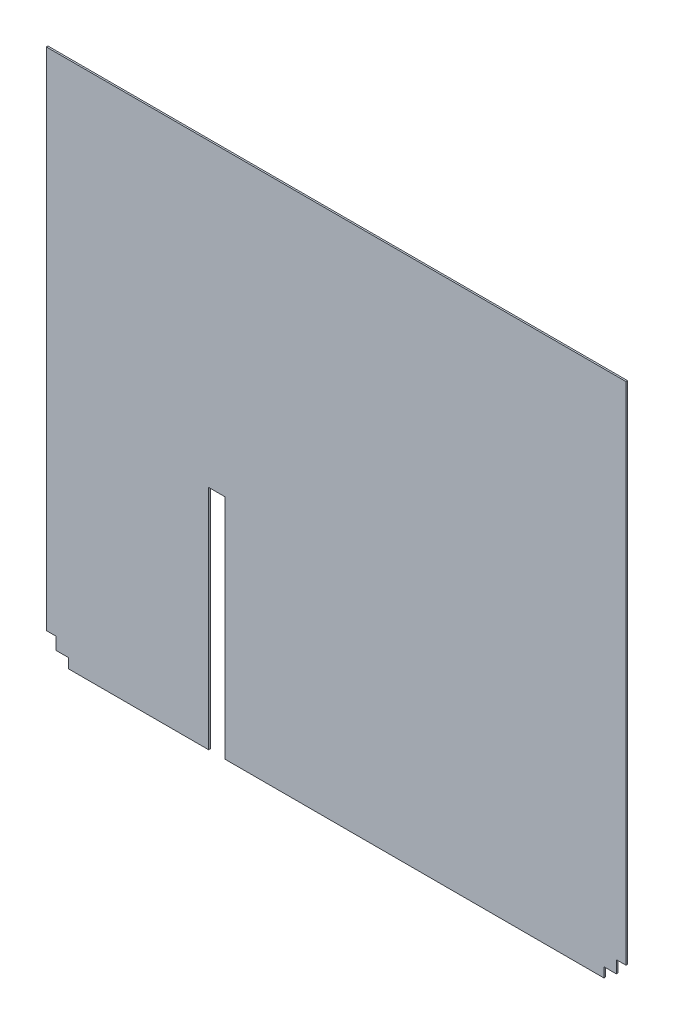
ISO-10303-21;
HEADER;
FILE_DESCRIPTION(('STEP AP214'),'2;1');
FILE_NAME('part.step','',(''),(''),'','','');
FILE_SCHEMA(('AUTOMOTIVE_DESIGN { 1 0 10303 214 1 1 1 1 }'));
ENDSEC;
DATA;
#1=APPLICATION_CONTEXT('core data for automotive mechanical design processes');
#2=APPLICATION_PROTOCOL_DEFINITION('international standard','automotive_design',2000,#1);
#3=PRODUCT_CONTEXT('',#1,'mechanical');
#4=PRODUCT('Part','Part','',(#3));
#5=PRODUCT_RELATED_PRODUCT_CATEGORY('part','',(#4));
#6=PRODUCT_DEFINITION_FORMATION('','',#4);
#7=PRODUCT_DEFINITION_CONTEXT('part definition',#1,'design');
#8=PRODUCT_DEFINITION('design','',#6,#7);
#9=PRODUCT_DEFINITION_SHAPE('','',#8);
#10=(LENGTH_UNIT() NAMED_UNIT(*) SI_UNIT(.MILLI.,.METRE.));
#11=(NAMED_UNIT(*) PLANE_ANGLE_UNIT() SI_UNIT($,.RADIAN.));
#12=(NAMED_UNIT(*) SI_UNIT($,.STERADIAN.) SOLID_ANGLE_UNIT());
#13=UNCERTAINTY_MEASURE_WITH_UNIT(LENGTH_MEASURE(1.E-05),#10,'distance_accuracy_value','');
#14=(GEOMETRIC_REPRESENTATION_CONTEXT(3) GLOBAL_UNCERTAINTY_ASSIGNED_CONTEXT((#13)) GLOBAL_UNIT_ASSIGNED_CONTEXT((#10,
#11,#12)) REPRESENTATION_CONTEXT('',''));
#15=CARTESIAN_POINT('',(0.,0.,0.));
#16=DIRECTION('',(0.,0.,1.));
#17=DIRECTION('',(1.,0.,0.));
#18=AXIS2_PLACEMENT_3D('',#15,#16,#17);
#19=CARTESIAN_POINT('',(0.,355.6,2.54));
#20=DIRECTION('',(0.,1.,0.));
#21=DIRECTION('',(0.,0.,1.));
#22=AXIS2_PLACEMENT_3D('',#19,#20,#21);
#23=PLANE('',#22);
#24=DIRECTION('',(1.,0.,0.));
#25=VECTOR('',#24,1.);
#26=CARTESIAN_POINT('',(0.,355.6,0.));
#27=LINE('',#26,#25);
#28=CARTESIAN_POINT('',(254.,355.6,0.));
#29=VERTEX_POINT('',#28);
#30=CARTESIAN_POINT('',(279.4,355.6,0.));
#31=VERTEX_POINT('',#30);
#32=EDGE_CURVE('E275',#29,#31,#27,.T.);
#33=ORIENTED_EDGE('',*,*,#32,.T.);
#34=DIRECTION('',(0.,0.,-1.));
#35=VECTOR('',#34,1.);
#36=CARTESIAN_POINT('',(279.4,355.6,2.54));
#37=LINE('',#36,#35);
#38=CARTESIAN_POINT('',(279.4,355.6,2.54));
#39=VERTEX_POINT('',#38);
#40=EDGE_CURVE('E11',#39,#31,#37,.T.);
#41=ORIENTED_EDGE('',*,*,#40,.F.);
#42=DIRECTION('',(1.,0.,0.));
#43=VECTOR('',#42,1.);
#44=CARTESIAN_POINT('',(0.,355.6,2.54));
#45=LINE('',#44,#43);
#46=CARTESIAN_POINT('',(254.,355.6,2.54));
#47=VERTEX_POINT('',#46);
#48=EDGE_CURVE('E206',#47,#39,#45,.T.);
#49=ORIENTED_EDGE('',*,*,#48,.F.);
#50=DIRECTION('',(0.,0.,-1.));
#51=VECTOR('',#50,1.);
#52=CARTESIAN_POINT('',(254.,355.6,2.54));
#53=LINE('',#52,#51);
#54=EDGE_CURVE('E193',#47,#29,#53,.T.);
#55=ORIENTED_EDGE('',*,*,#54,.T.);
#56=EDGE_LOOP('',(#33,#41,#49,#55));
#57=FACE_BOUND('',#56,.T.);
#58=ADVANCED_FACE('F47',(#57),#23,.F.);
#59=CARTESIAN_POINT('',(279.4,0.,2.54));
#60=DIRECTION('',(1.,0.,0.));
#61=DIRECTION('',(0.,1.,0.));
#62=AXIS2_PLACEMENT_3D('',#59,#60,#61);
#63=PLANE('',#62);
#64=DIRECTION('',(0.,-1.,0.));
#65=VECTOR('',#64,1.);
#66=CARTESIAN_POINT('',(279.4,0.,0.));
#67=LINE('',#66,#65);
#68=CARTESIAN_POINT('',(279.4,0.,0.));
#69=VERTEX_POINT('',#68);
#70=EDGE_CURVE('E266',#31,#69,#67,.T.);
#71=ORIENTED_EDGE('',*,*,#70,.T.);
#72=DIRECTION('',(0.,0.,-1.));
#73=VECTOR('',#72,1.);
#74=CARTESIAN_POINT('',(279.4,0.,2.54));
#75=LINE('',#74,#73);
#76=CARTESIAN_POINT('',(279.4,0.,2.54));
#77=VERTEX_POINT('',#76);
#78=EDGE_CURVE('E56',#77,#69,#75,.T.);
#79=ORIENTED_EDGE('',*,*,#78,.F.);
#80=DIRECTION('',(0.,-1.,0.));
#81=VECTOR('',#80,1.);
#82=CARTESIAN_POINT('',(279.4,0.,2.54));
#83=LINE('',#82,#81);
#84=EDGE_CURVE('E131',#39,#77,#83,.T.);
#85=ORIENTED_EDGE('',*,*,#84,.F.);
#86=ORIENTED_EDGE('',*,*,#40,.T.);
#87=EDGE_LOOP('',(#71,#79,#85,#86));
#88=FACE_BOUND('',#87,.T.);
#89=ADVANCED_FACE('F389',(#88),#63,.F.);
#90=CARTESIAN_POINT('',(0.,0.,2.54));
#91=DIRECTION('',(0.,1.,0.));
#92=DIRECTION('',(0.,0.,1.));
#93=AXIS2_PLACEMENT_3D('',#90,#91,#92);
#94=PLANE('',#93);
#95=DIRECTION('',(1.,0.,0.));
#96=VECTOR('',#95,1.);
#97=CARTESIAN_POINT('',(0.,0.,0.));
#98=LINE('',#97,#96);
#99=CARTESIAN_POINT('',(872.45698,0.,0.));
#100=VERTEX_POINT('',#99);
#101=EDGE_CURVE('E215',#69,#100,#98,.T.);
#102=ORIENTED_EDGE('',*,*,#101,.T.);
#103=DIRECTION('',(0.,0.,-1.));
#104=VECTOR('',#103,1.);
#105=CARTESIAN_POINT('',(872.45698,0.,2.54));
#106=LINE('',#105,#104);
#107=CARTESIAN_POINT('',(872.45698,0.,2.54));
#108=VERTEX_POINT('',#107);
#109=EDGE_CURVE('E254',#108,#100,#106,.T.);
#110=ORIENTED_EDGE('',*,*,#109,.F.);
#111=DIRECTION('',(1.,0.,0.));
#112=VECTOR('',#111,1.);
#113=CARTESIAN_POINT('',(0.,0.,2.54));
#114=LINE('',#113,#112);
#115=EDGE_CURVE('E191',#77,#108,#114,.T.);
#116=ORIENTED_EDGE('',*,*,#115,.F.);
#117=ORIENTED_EDGE('',*,*,#78,.T.);
#118=EDGE_LOOP('',(#102,#110,#116,#117));
#119=FACE_BOUND('',#118,.T.);
#120=ADVANCED_FACE('F261',(#119),#94,.F.);
#121=CARTESIAN_POINT('',(872.45698,0.,2.54));
#122=DIRECTION('',(1.,0.,0.));
#123=DIRECTION('',(0.,0.,-1.));
#124=AXIS2_PLACEMENT_3D('',#121,#122,#123);
#125=PLANE('',#124);
#126=DIRECTION('',(0.,-1.,0.));
#127=VECTOR('',#126,1.);
#128=CARTESIAN_POINT('',(872.45698,0.,0.));
#129=LINE('',#128,#127);
#130=CARTESIAN_POINT('',(872.45698,15.24,0.));
#131=VERTEX_POINT('',#130);
#132=EDGE_CURVE('E269',#131,#100,#129,.T.);
#133=ORIENTED_EDGE('',*,*,#132,.F.);
#134=DIRECTION('',(0.,0.,-1.));
#135=VECTOR('',#134,1.);
#136=CARTESIAN_POINT('',(872.45698,15.24,2.54));
#137=LINE('',#136,#135);
#138=CARTESIAN_POINT('',(872.45698,15.24,2.54));
#139=VERTEX_POINT('',#138);
#140=EDGE_CURVE('E251',#139,#131,#137,.T.);
#141=ORIENTED_EDGE('',*,*,#140,.F.);
#142=DIRECTION('',(0.,-1.,0.));
#143=VECTOR('',#142,1.);
#144=CARTESIAN_POINT('',(872.45698,0.,2.54));
#145=LINE('',#144,#143);
#146=EDGE_CURVE('E198',#139,#108,#145,.T.);
#147=ORIENTED_EDGE('',*,*,#146,.T.);
#148=ORIENTED_EDGE('',*,*,#109,.T.);
#149=EDGE_LOOP('',(#133,#141,#147,#148));
#150=FACE_BOUND('',#149,.T.);
#151=ADVANCED_FACE('F396',(#150),#125,.T.);
#152=CARTESIAN_POINT('',(0.,15.2399999999999,2.54));
#153=DIRECTION('',(0.,-1.,0.));
#154=DIRECTION('',(1.,0.,0.));
#155=AXIS2_PLACEMENT_3D('',#152,#153,#154);
#156=PLANE('',#155);
#157=DIRECTION('',(-1.,0.,0.));
#158=VECTOR('',#157,1.);
#159=CARTESIAN_POINT('',(0.,15.2399999999999,0.));
#160=LINE('',#159,#158);
#161=CARTESIAN_POINT('',(891.76098,15.24,0.));
#162=VERTEX_POINT('',#161);
#163=EDGE_CURVE('E273',#162,#131,#160,.T.);
#164=ORIENTED_EDGE('',*,*,#163,.F.);
#165=DIRECTION('',(0.,0.,-1.));
#166=VECTOR('',#165,1.);
#167=CARTESIAN_POINT('',(891.76098,15.24,2.54));
#168=LINE('',#167,#166);
#169=CARTESIAN_POINT('',(891.76098,15.24,2.54));
#170=VERTEX_POINT('',#169);
#171=EDGE_CURVE('E248',#170,#162,#168,.T.);
#172=ORIENTED_EDGE('',*,*,#171,.F.);
#173=DIRECTION('',(-1.,0.,0.));
#174=VECTOR('',#173,1.);
#175=CARTESIAN_POINT('',(0.,15.2399999999999,2.54));
#176=LINE('',#175,#174);
#177=EDGE_CURVE('E205',#170,#139,#176,.T.);
#178=ORIENTED_EDGE('',*,*,#177,.T.);
#179=ORIENTED_EDGE('',*,*,#140,.T.);
#180=EDGE_LOOP('',(#164,#172,#178,#179));
#181=FACE_BOUND('',#180,.T.);
#182=ADVANCED_FACE('F350',(#181),#156,.T.);
#183=CARTESIAN_POINT('',(891.76098,0.,2.54));
#184=DIRECTION('',(1.,0.,0.));
#185=DIRECTION('',(0.,0.,-1.));
#186=AXIS2_PLACEMENT_3D('',#183,#184,#185);
#187=PLANE('',#186);
#188=DIRECTION('',(0.,-1.,0.));
#189=VECTOR('',#188,1.);
#190=CARTESIAN_POINT('',(891.76098,0.,0.));
#191=LINE('',#190,#189);
#192=CARTESIAN_POINT('',(891.76098,34.544,0.));
#193=VERTEX_POINT('',#192);
#194=EDGE_CURVE('E281',#193,#162,#191,.T.);
#195=ORIENTED_EDGE('',*,*,#194,.F.);
#196=DIRECTION('',(0.,0.,-1.));
#197=VECTOR('',#196,1.);
#198=CARTESIAN_POINT('',(891.76098,34.544,2.54));
#199=LINE('',#198,#197);
#200=CARTESIAN_POINT('',(891.76098,34.544,2.54));
#201=VERTEX_POINT('',#200);
#202=EDGE_CURVE('E245',#201,#193,#199,.T.);
#203=ORIENTED_EDGE('',*,*,#202,.F.);
#204=DIRECTION('',(0.,-1.,0.));
#205=VECTOR('',#204,1.);
#206=CARTESIAN_POINT('',(891.76098,0.,2.54));
#207=LINE('',#206,#205);
#208=EDGE_CURVE('E341',#201,#170,#207,.T.);
#209=ORIENTED_EDGE('',*,*,#208,.T.);
#210=ORIENTED_EDGE('',*,*,#171,.T.);
#211=EDGE_LOOP('',(#195,#203,#209,#210));
#212=FACE_BOUND('',#211,.T.);
#213=ADVANCED_FACE('F355',(#212),#187,.T.);
#214=CARTESIAN_POINT('',(0.,34.5439999999996,2.54));
#215=DIRECTION('',(0.,-1.,0.));
#216=DIRECTION('',(1.,0.,0.));
#217=AXIS2_PLACEMENT_3D('',#214,#215,#216);
#218=PLANE('',#217);
#219=DIRECTION('',(-1.,0.,0.));
#220=VECTOR('',#219,1.);
#221=CARTESIAN_POINT('',(0.,34.5439999999996,0.));
#222=LINE('',#221,#220);
#223=CARTESIAN_POINT('',(907.00098,34.544,0.));
#224=VERTEX_POINT('',#223);
#225=EDGE_CURVE('E285',#224,#193,#222,.T.);
#226=ORIENTED_EDGE('',*,*,#225,.F.);
#227=DIRECTION('',(0.,0.,-1.));
#228=VECTOR('',#227,1.);
#229=CARTESIAN_POINT('',(907.00098,34.544,2.54));
#230=LINE('',#229,#228);
#231=CARTESIAN_POINT('',(907.00098,34.544,2.54));
#232=VERTEX_POINT('',#231);
#233=EDGE_CURVE('E242',#232,#224,#230,.T.);
#234=ORIENTED_EDGE('',*,*,#233,.F.);
#235=DIRECTION('',(-1.,0.,0.));
#236=VECTOR('',#235,1.);
#237=CARTESIAN_POINT('',(0.,34.5439999999996,2.54));
#238=LINE('',#237,#236);
#239=EDGE_CURVE('E337',#232,#201,#238,.T.);
#240=ORIENTED_EDGE('',*,*,#239,.T.);
#241=ORIENTED_EDGE('',*,*,#202,.T.);
#242=EDGE_LOOP('',(#226,#234,#240,#241));
#243=FACE_BOUND('',#242,.T.);
#244=ADVANCED_FACE('F358',(#243),#218,.T.);
#245=CARTESIAN_POINT('',(907.00098,0.,2.54));
#246=DIRECTION('',(-1.,0.,0.));
#247=DIRECTION('',(0.,0.,1.));
#248=AXIS2_PLACEMENT_3D('',#245,#246,#247);
#249=PLANE('',#248);
#250=DIRECTION('',(0.,1.,0.));
#251=VECTOR('',#250,1.);
#252=CARTESIAN_POINT('',(907.00098,0.,0.));
#253=LINE('',#252,#251);
#254=CARTESIAN_POINT('',(907.00098,825.5,0.));
#255=VERTEX_POINT('',#254);
#256=EDGE_CURVE('E289',#224,#255,#253,.T.);
#257=ORIENTED_EDGE('',*,*,#256,.T.);
#258=DIRECTION('',(0.,0.,-1.));
#259=VECTOR('',#258,1.);
#260=CARTESIAN_POINT('',(907.00098,825.5,2.54));
#261=LINE('',#260,#259);
#262=CARTESIAN_POINT('',(907.00098,825.5,2.54));
#263=VERTEX_POINT('',#262);
#264=EDGE_CURVE('E239',#263,#255,#261,.T.);
#265=ORIENTED_EDGE('',*,*,#264,.F.);
#266=DIRECTION('',(0.,1.,0.));
#267=VECTOR('',#266,1.);
#268=CARTESIAN_POINT('',(907.00098,0.,2.54));
#269=LINE('',#268,#267);
#270=EDGE_CURVE('E334',#232,#263,#269,.T.);
#271=ORIENTED_EDGE('',*,*,#270,.F.);
#272=ORIENTED_EDGE('',*,*,#233,.T.);
#273=EDGE_LOOP('',(#257,#265,#271,#272));
#274=FACE_BOUND('',#273,.T.);
#275=ADVANCED_FACE('F364',(#274),#249,.F.);
#276=CARTESIAN_POINT('',(0.,825.5,2.54));
#277=DIRECTION('',(0.,1.,0.));
#278=DIRECTION('',(0.,0.,1.));
#279=AXIS2_PLACEMENT_3D('',#276,#277,#278);
#280=PLANE('',#279);
#281=DIRECTION('',(1.,0.,0.));
#282=VECTOR('',#281,1.);
#283=CARTESIAN_POINT('',(0.,825.5,0.));
#284=LINE('',#283,#282);
#285=CARTESIAN_POINT('',(0.,825.5,0.));
#286=VERTEX_POINT('',#285);
#287=EDGE_CURVE('E293',#286,#255,#284,.T.);
#288=ORIENTED_EDGE('',*,*,#287,.F.);
#289=DIRECTION('',(0.,0.,-1.));
#290=VECTOR('',#289,1.);
#291=CARTESIAN_POINT('',(0.,825.5,2.54));
#292=LINE('',#291,#290);
#293=CARTESIAN_POINT('',(0.,825.5,2.54));
#294=VERTEX_POINT('',#293);
#295=EDGE_CURVE('E236',#294,#286,#292,.T.);
#296=ORIENTED_EDGE('',*,*,#295,.F.);
#297=DIRECTION('',(1.,0.,0.));
#298=VECTOR('',#297,1.);
#299=CARTESIAN_POINT('',(0.,825.5,2.54));
#300=LINE('',#299,#298);
#301=EDGE_CURVE('E330',#294,#263,#300,.T.);
#302=ORIENTED_EDGE('',*,*,#301,.T.);
#303=ORIENTED_EDGE('',*,*,#264,.T.);
#304=EDGE_LOOP('',(#288,#296,#302,#303));
#305=FACE_BOUND('',#304,.T.);
#306=ADVANCED_FACE('F368',(#305),#280,.T.);
#307=CARTESIAN_POINT('',(0.,0.,2.54));
#308=DIRECTION('',(-1.,0.,0.));
#309=DIRECTION('',(0.,0.,1.));
#310=AXIS2_PLACEMENT_3D('',#307,#308,#309);
#311=PLANE('',#310);
#312=DIRECTION('',(0.,1.,0.));
#313=VECTOR('',#312,1.);
#314=CARTESIAN_POINT('',(0.,0.,0.));
#315=LINE('',#314,#313);
#316=CARTESIAN_POINT('',(0.,34.544,0.));
#317=VERTEX_POINT('',#316);
#318=EDGE_CURVE('E297',#317,#286,#315,.T.);
#319=ORIENTED_EDGE('',*,*,#318,.F.);
#320=DIRECTION('',(0.,0.,-1.));
#321=VECTOR('',#320,1.);
#322=CARTESIAN_POINT('',(0.,34.544,2.54));
#323=LINE('',#322,#321);
#324=CARTESIAN_POINT('',(0.,34.544,2.54));
#325=VERTEX_POINT('',#324);
#326=EDGE_CURVE('E233',#325,#317,#323,.T.);
#327=ORIENTED_EDGE('',*,*,#326,.F.);
#328=DIRECTION('',(0.,1.,0.));
#329=VECTOR('',#328,1.);
#330=CARTESIAN_POINT('',(0.,0.,2.54));
#331=LINE('',#330,#329);
#332=EDGE_CURVE('E326',#325,#294,#331,.T.);
#333=ORIENTED_EDGE('',*,*,#332,.T.);
#334=ORIENTED_EDGE('',*,*,#295,.T.);
#335=EDGE_LOOP('',(#319,#327,#333,#334));
#336=FACE_BOUND('',#335,.T.);
#337=ADVANCED_FACE('F371',(#336),#311,.T.);
#338=CARTESIAN_POINT('',(0.,34.544,2.54));
#339=DIRECTION('',(0.,1.,0.));
#340=DIRECTION('',(0.,0.,1.));
#341=AXIS2_PLACEMENT_3D('',#338,#339,#340);
#342=PLANE('',#341);
#343=DIRECTION('',(1.,0.,0.));
#344=VECTOR('',#343,1.);
#345=CARTESIAN_POINT('',(0.,34.544,0.));
#346=LINE('',#345,#344);
#347=CARTESIAN_POINT('',(15.24,34.544,0.));
#348=VERTEX_POINT('',#347);
#349=EDGE_CURVE('E301',#317,#348,#346,.T.);
#350=ORIENTED_EDGE('',*,*,#349,.T.);
#351=DIRECTION('',(0.,0.,-1.));
#352=VECTOR('',#351,1.);
#353=CARTESIAN_POINT('',(15.24,34.544,2.54));
#354=LINE('',#353,#352);
#355=CARTESIAN_POINT('',(15.24,34.544,2.54));
#356=VERTEX_POINT('',#355);
#357=EDGE_CURVE('E229',#356,#348,#354,.T.);
#358=ORIENTED_EDGE('',*,*,#357,.F.);
#359=DIRECTION('',(1.,0.,0.));
#360=VECTOR('',#359,1.);
#361=CARTESIAN_POINT('',(0.,34.544,2.54));
#362=LINE('',#361,#360);
#363=EDGE_CURVE('E323',#325,#356,#362,.T.);
#364=ORIENTED_EDGE('',*,*,#363,.F.);
#365=ORIENTED_EDGE('',*,*,#326,.T.);
#366=EDGE_LOOP('',(#350,#358,#364,#365));
#367=FACE_BOUND('',#366,.T.);
#368=ADVANCED_FACE('F376',(#367),#342,.F.);
#369=CARTESIAN_POINT('',(15.24,0.,2.54));
#370=DIRECTION('',(1.,0.,0.));
#371=DIRECTION('',(0.,1.,0.));
#372=AXIS2_PLACEMENT_3D('',#369,#370,#371);
#373=PLANE('',#372);
#374=DIRECTION('',(0.,-1.,0.));
#375=VECTOR('',#374,1.);
#376=CARTESIAN_POINT('',(15.24,0.,0.));
#377=LINE('',#376,#375);
#378=CARTESIAN_POINT('',(15.24,15.24,0.));
#379=VERTEX_POINT('',#378);
#380=EDGE_CURVE('E304',#348,#379,#377,.T.);
#381=ORIENTED_EDGE('',*,*,#380,.T.);
#382=DIRECTION('',(0.,0.,-1.));
#383=VECTOR('',#382,1.);
#384=CARTESIAN_POINT('',(15.24,15.24,2.54));
#385=LINE('',#384,#383);
#386=CARTESIAN_POINT('',(15.24,15.24,2.54));
#387=VERTEX_POINT('',#386);
#388=EDGE_CURVE('E225',#387,#379,#385,.T.);
#389=ORIENTED_EDGE('',*,*,#388,.F.);
#390=DIRECTION('',(0.,-1.,0.));
#391=VECTOR('',#390,1.);
#392=CARTESIAN_POINT('',(15.24,0.,2.54));
#393=LINE('',#392,#391);
#394=EDGE_CURVE('E320',#356,#387,#393,.T.);
#395=ORIENTED_EDGE('',*,*,#394,.F.);
#396=ORIENTED_EDGE('',*,*,#357,.T.);
#397=EDGE_LOOP('',(#381,#389,#395,#396));
#398=FACE_BOUND('',#397,.T.);
#399=ADVANCED_FACE('F379',(#398),#373,.F.);
#400=CARTESIAN_POINT('',(0.,15.24,2.54));
#401=DIRECTION('',(0.,1.,0.));
#402=DIRECTION('',(0.,0.,1.));
#403=AXIS2_PLACEMENT_3D('',#400,#401,#402);
#404=PLANE('',#403);
#405=DIRECTION('',(1.,0.,0.));
#406=VECTOR('',#405,1.);
#407=CARTESIAN_POINT('',(0.,15.24,0.));
#408=LINE('',#407,#406);
#409=CARTESIAN_POINT('',(34.544,15.24,0.));
#410=VERTEX_POINT('',#409);
#411=EDGE_CURVE('E306',#379,#410,#408,.T.);
#412=ORIENTED_EDGE('',*,*,#411,.T.);
#413=DIRECTION('',(0.,0.,-1.));
#414=VECTOR('',#413,1.);
#415=CARTESIAN_POINT('',(34.544,15.24,2.54));
#416=LINE('',#415,#414);
#417=CARTESIAN_POINT('',(34.544,15.24,2.54));
#418=VERTEX_POINT('',#417);
#419=EDGE_CURVE('E185',#418,#410,#416,.T.);
#420=ORIENTED_EDGE('',*,*,#419,.F.);
#421=DIRECTION('',(1.,0.,0.));
#422=VECTOR('',#421,1.);
#423=CARTESIAN_POINT('',(0.,15.24,2.54));
#424=LINE('',#423,#422);
#425=EDGE_CURVE('E174',#387,#418,#424,.T.);
#426=ORIENTED_EDGE('',*,*,#425,.F.);
#427=ORIENTED_EDGE('',*,*,#388,.T.);
#428=EDGE_LOOP('',(#412,#420,#426,#427));
#429=FACE_BOUND('',#428,.T.);
#430=ADVANCED_FACE('F311',(#429),#404,.F.);
#431=CARTESIAN_POINT('',(34.544,0.,2.54));
#432=DIRECTION('',(1.,0.,0.));
#433=DIRECTION('',(0.,0.,-1.));
#434=AXIS2_PLACEMENT_3D('',#431,#432,#433);
#435=PLANE('',#434);
#436=DIRECTION('',(0.,-1.,0.));
#437=VECTOR('',#436,1.);
#438=CARTESIAN_POINT('',(34.544,0.,0.));
#439=LINE('',#438,#437);
#440=CARTESIAN_POINT('',(34.544,0.,0.));
#441=VERTEX_POINT('',#440);
#442=EDGE_CURVE('E183',#410,#441,#439,.T.);
#443=ORIENTED_EDGE('',*,*,#442,.T.);
#444=DIRECTION('',(0.,0.,-1.));
#445=VECTOR('',#444,1.);
#446=CARTESIAN_POINT('',(34.544,0.,2.54));
#447=LINE('',#446,#445);
#448=CARTESIAN_POINT('',(34.544,0.,2.54));
#449=VERTEX_POINT('',#448);
#450=EDGE_CURVE('E180',#449,#441,#447,.T.);
#451=ORIENTED_EDGE('',*,*,#450,.F.);
#452=DIRECTION('',(0.,-1.,0.));
#453=VECTOR('',#452,1.);
#454=CARTESIAN_POINT('',(34.544,0.,2.54));
#455=LINE('',#454,#453);
#456=EDGE_CURVE('E168',#418,#449,#455,.T.);
#457=ORIENTED_EDGE('',*,*,#456,.F.);
#458=ORIENTED_EDGE('',*,*,#419,.T.);
#459=EDGE_LOOP('',(#443,#451,#457,#458));
#460=FACE_BOUND('',#459,.T.);
#461=ADVANCED_FACE('F181',(#460),#435,.F.);
#462=CARTESIAN_POINT('',(254.,0.,0.));
#463=VERTEX_POINT('',#462);
#464=EDGE_CURVE('E117',#441,#463,#98,.T.);
#465=ORIENTED_EDGE('',*,*,#464,.T.);
#466=DIRECTION('',(0.,0.,-1.));
#467=VECTOR('',#466,1.);
#468=CARTESIAN_POINT('',(254.,0.,2.54));
#469=LINE('',#468,#467);
#470=CARTESIAN_POINT('',(254.,0.,2.54));
#471=VERTEX_POINT('',#470);
#472=EDGE_CURVE('E186',#471,#463,#469,.T.);
#473=ORIENTED_EDGE('',*,*,#472,.F.);
#474=EDGE_CURVE('E172',#449,#471,#114,.T.);
#475=ORIENTED_EDGE('',*,*,#474,.F.);
#476=ORIENTED_EDGE('',*,*,#450,.T.);
#477=EDGE_LOOP('',(#465,#473,#475,#476));
#478=FACE_BOUND('',#477,.T.);
#479=ADVANCED_FACE('F188',(#478),#94,.F.);
#480=CARTESIAN_POINT('',(254.,0.,2.54));
#481=DIRECTION('',(-1.,0.,0.));
#482=DIRECTION('',(0.,-1.,0.));
#483=AXIS2_PLACEMENT_3D('',#480,#481,#482);
#484=PLANE('',#483);
#485=DIRECTION('',(0.,1.,0.));
#486=VECTOR('',#485,1.);
#487=CARTESIAN_POINT('',(254.,0.,0.));
#488=LINE('',#487,#486);
#489=EDGE_CURVE('E123',#463,#29,#488,.T.);
#490=ORIENTED_EDGE('',*,*,#489,.T.);
#491=ORIENTED_EDGE('',*,*,#54,.F.);
#492=DIRECTION('',(0.,1.,0.));
#493=VECTOR('',#492,1.);
#494=CARTESIAN_POINT('',(254.,0.,2.54));
#495=LINE('',#494,#493);
#496=EDGE_CURVE('E64',#471,#47,#495,.T.);
#497=ORIENTED_EDGE('',*,*,#496,.F.);
#498=ORIENTED_EDGE('',*,*,#472,.T.);
#499=EDGE_LOOP('',(#490,#491,#497,#498));
#500=FACE_BOUND('',#499,.T.);
#501=ADVANCED_FACE('F450',(#500),#484,.F.);
#502=CARTESIAN_POINT('',(0.,0.,2.54));
#503=DIRECTION('',(0.,0.,1.));
#504=DIRECTION('',(1.,0.,0.));
#505=AXIS2_PLACEMENT_3D('',#502,#503,#504);
#506=PLANE('',#505);
#507=ORIENTED_EDGE('',*,*,#48,.T.);
#508=ORIENTED_EDGE('',*,*,#84,.T.);
#509=ORIENTED_EDGE('',*,*,#115,.T.);
#510=ORIENTED_EDGE('',*,*,#146,.F.);
#511=ORIENTED_EDGE('',*,*,#177,.F.);
#512=ORIENTED_EDGE('',*,*,#208,.F.);
#513=ORIENTED_EDGE('',*,*,#239,.F.);
#514=ORIENTED_EDGE('',*,*,#270,.T.);
#515=ORIENTED_EDGE('',*,*,#301,.F.);
#516=ORIENTED_EDGE('',*,*,#332,.F.);
#517=ORIENTED_EDGE('',*,*,#363,.T.);
#518=ORIENTED_EDGE('',*,*,#394,.T.);
#519=ORIENTED_EDGE('',*,*,#425,.T.);
#520=ORIENTED_EDGE('',*,*,#456,.T.);
#521=ORIENTED_EDGE('',*,*,#474,.T.);
#522=ORIENTED_EDGE('',*,*,#496,.T.);
#523=EDGE_LOOP('',(#507,#508,#509,#510,#511,#512,#513,#514,#515,#516,#517,#518,#519,#520,#521,#522));
#524=FACE_BOUND('',#523,.T.);
#525=ADVANCED_FACE('F170',(#524),#506,.T.);
#526=CARTESIAN_POINT('',(0.,0.,0.));
#527=DIRECTION('',(0.,0.,1.));
#528=DIRECTION('',(1.,0.,0.));
#529=AXIS2_PLACEMENT_3D('',#526,#527,#528);
#530=PLANE('',#529);
#531=ORIENTED_EDGE('',*,*,#32,.F.);
#532=ORIENTED_EDGE('',*,*,#489,.F.);
#533=ORIENTED_EDGE('',*,*,#464,.F.);
#534=ORIENTED_EDGE('',*,*,#442,.F.);
#535=ORIENTED_EDGE('',*,*,#411,.F.);
#536=ORIENTED_EDGE('',*,*,#380,.F.);
#537=ORIENTED_EDGE('',*,*,#349,.F.);
#538=ORIENTED_EDGE('',*,*,#318,.T.);
#539=ORIENTED_EDGE('',*,*,#287,.T.);
#540=ORIENTED_EDGE('',*,*,#256,.F.);
#541=ORIENTED_EDGE('',*,*,#225,.T.);
#542=ORIENTED_EDGE('',*,*,#194,.T.);
#543=ORIENTED_EDGE('',*,*,#163,.T.);
#544=ORIENTED_EDGE('',*,*,#132,.T.);
#545=ORIENTED_EDGE('',*,*,#101,.F.);
#546=ORIENTED_EDGE('',*,*,#70,.F.);
#547=EDGE_LOOP('',(#531,#532,#533,#534,#535,#536,#537,#538,#539,#540,#541,#542,#543,#544,#545,#546));
#548=FACE_BOUND('',#547,.T.);
#549=ADVANCED_FACE('F265',(#548),#530,.F.);
#550=CLOSED_SHELL('',(#58,#89,#120,#151,#182,#213,#244,#275,#306,#337,#368,#399,#430,#461,#479,
#501,#525,#549));
#551=MANIFOLD_SOLID_BREP('B2',#550);
#552=ADVANCED_BREP_SHAPE_REPRESENTATION('',(#18,#551),#14);
#553=SHAPE_DEFINITION_REPRESENTATION(#9,#552);
ENDSEC;
END-ISO-10303-21;
